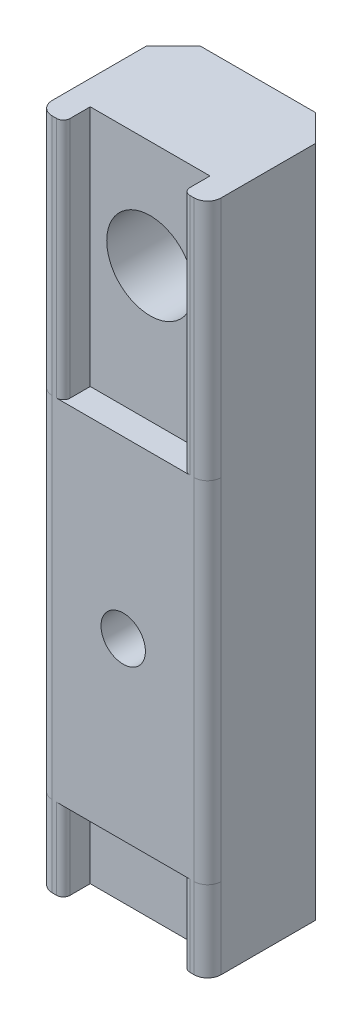
ISO-10303-21;
HEADER;
FILE_DESCRIPTION(('STEP AP214'),'2;1');
FILE_NAME('part.step','',(''),(''),'','','');
FILE_SCHEMA(('AUTOMOTIVE_DESIGN { 1 0 10303 214 1 1 1 1 }'));
ENDSEC;
DATA;
#1=APPLICATION_CONTEXT('core data for automotive mechanical design processes');
#2=APPLICATION_PROTOCOL_DEFINITION('international standard','automotive_design',2000,#1);
#3=PRODUCT_CONTEXT('',#1,'mechanical');
#4=PRODUCT('Part','Part','',(#3));
#5=PRODUCT_RELATED_PRODUCT_CATEGORY('part','',(#4));
#6=PRODUCT_DEFINITION_FORMATION('','',#4);
#7=PRODUCT_DEFINITION_CONTEXT('part definition',#1,'design');
#8=PRODUCT_DEFINITION('design','',#6,#7);
#9=PRODUCT_DEFINITION_SHAPE('','',#8);
#10=(LENGTH_UNIT() NAMED_UNIT(*) SI_UNIT(.MILLI.,.METRE.));
#11=(NAMED_UNIT(*) PLANE_ANGLE_UNIT() SI_UNIT($,.RADIAN.));
#12=(NAMED_UNIT(*) SI_UNIT($,.STERADIAN.) SOLID_ANGLE_UNIT());
#13=UNCERTAINTY_MEASURE_WITH_UNIT(LENGTH_MEASURE(1.E-05),#10,'distance_accuracy_value','');
#14=(GEOMETRIC_REPRESENTATION_CONTEXT(3) GLOBAL_UNCERTAINTY_ASSIGNED_CONTEXT((#13)) GLOBAL_UNIT_ASSIGNED_CONTEXT((#10,
#11,#12)) REPRESENTATION_CONTEXT('',''));
#15=CARTESIAN_POINT('',(0.,0.,0.));
#16=DIRECTION('',(0.,0.,1.));
#17=DIRECTION('',(1.,0.,0.));
#18=AXIS2_PLACEMENT_3D('',#15,#16,#17);
#19=CARTESIAN_POINT('',(0.,6.00000000000001,28.8704433634123));
#20=DIRECTION('',(0.,1.,0.));
#21=DIRECTION('',(0.,0.,1.));
#22=AXIS2_PLACEMENT_3D('',#19,#20,#21);
#23=PLANE('',#22);
#24=DIRECTION('',(-1.,0.,0.));
#25=VECTOR('',#24,1.);
#26=CARTESIAN_POINT('',(1.825,6.00000000000001,-2.));
#27=LINE('',#26,#25);
#28=CARTESIAN_POINT('',(10.725,6.00000000000001,-2.));
#29=VERTEX_POINT('',#28);
#30=CARTESIAN_POINT('',(1.825,6.00000000000001,-2.));
#31=VERTEX_POINT('',#30);
#32=EDGE_CURVE('E250',#29,#31,#27,.T.);
#33=ORIENTED_EDGE('',*,*,#32,.F.);
#34=DIRECTION('',(0.,0.,1.));
#35=VECTOR('',#34,1.);
#36=CARTESIAN_POINT('',(10.725,6.00000000000001,-2.));
#37=LINE('',#36,#35);
#38=CARTESIAN_POINT('',(10.725,6.00000000000001,-0.5));
#39=VERTEX_POINT('',#38);
#40=EDGE_CURVE('E338',#29,#39,#37,.T.);
#41=ORIENTED_EDGE('',*,*,#40,.T.);
#42=CARTESIAN_POINT('',(11.225,6.00000000000001,-0.5));
#43=DIRECTION('',(0.,1.,0.));
#44=DIRECTION('',(0.,0.,1.));
#45=AXIS2_PLACEMENT_3D('',#42,#43,#44);
#46=CIRCLE('',#45,0.5);
#47=CARTESIAN_POINT('',(11.225,6.00000000000001,0.));
#48=VERTEX_POINT('',#47);
#49=EDGE_CURVE('E254',#48,#39,#46,.F.);
#50=ORIENTED_EDGE('',*,*,#49,.F.);
#51=DIRECTION('',(-1.,0.,0.));
#52=VECTOR('',#51,1.);
#53=CARTESIAN_POINT('',(0.,6.00000000000001,0.));
#54=LINE('',#53,#52);
#55=CARTESIAN_POINT('',(1.325,6.00000000000001,0.));
#56=VERTEX_POINT('',#55);
#57=EDGE_CURVE('E317',#48,#56,#54,.T.);
#58=ORIENTED_EDGE('',*,*,#57,.T.);
#59=CARTESIAN_POINT('',(1.325,6.00000000000001,-0.5));
#60=DIRECTION('',(0.,1.,0.));
#61=DIRECTION('',(0.,0.,1.));
#62=AXIS2_PLACEMENT_3D('',#59,#60,#61);
#63=CIRCLE('',#62,0.5);
#64=CARTESIAN_POINT('',(1.825,6.00000000000001,-0.5));
#65=VERTEX_POINT('',#64);
#66=EDGE_CURVE('E253',#65,#56,#63,.F.);
#67=ORIENTED_EDGE('',*,*,#66,.F.);
#68=DIRECTION('',(0.,0.,-1.));
#69=VECTOR('',#68,1.);
#70=CARTESIAN_POINT('',(1.825,6.00000000000001,0.));
#71=LINE('',#70,#69);
#72=EDGE_CURVE('E238',#65,#31,#71,.T.);
#73=ORIENTED_EDGE('',*,*,#72,.T.);
#74=EDGE_LOOP('',(#33,#41,#50,#58,#67,#73));
#75=FACE_BOUND('',#74,.T.);
#76=ADVANCED_FACE('F36',(#75),#23,.F.);
#77=CARTESIAN_POINT('',(0.,32.,28.8704433634123));
#78=DIRECTION('',(0.,-1.,0.));
#79=DIRECTION('',(0.,0.,-1.));
#80=AXIS2_PLACEMENT_3D('',#77,#78,#79);
#81=PLANE('',#80);
#82=DIRECTION('',(1.,0.,0.));
#83=VECTOR('',#82,1.);
#84=CARTESIAN_POINT('',(1.825,32.,-2.));
#85=LINE('',#84,#83);
#86=CARTESIAN_POINT('',(1.825,32.,-2.));
#87=VERTEX_POINT('',#86);
#88=CARTESIAN_POINT('',(10.725,32.,-2.));
#89=VERTEX_POINT('',#88);
#90=EDGE_CURVE('E264',#87,#89,#85,.T.);
#91=ORIENTED_EDGE('',*,*,#90,.F.);
#92=DIRECTION('',(0.,0.,1.));
#93=VECTOR('',#92,1.);
#94=CARTESIAN_POINT('',(1.825,32.,0.));
#95=LINE('',#94,#93);
#96=CARTESIAN_POINT('',(1.825,32.,-0.5));
#97=VERTEX_POINT('',#96);
#98=EDGE_CURVE('E324',#87,#97,#95,.T.);
#99=ORIENTED_EDGE('',*,*,#98,.T.);
#100=CARTESIAN_POINT('',(1.325,32.,-0.5));
#101=DIRECTION('',(0.,-1.,0.));
#102=DIRECTION('',(0.,0.,-1.));
#103=AXIS2_PLACEMENT_3D('',#100,#101,#102);
#104=CIRCLE('',#103,0.5);
#105=CARTESIAN_POINT('',(1.325,32.,0.));
#106=VERTEX_POINT('',#105);
#107=EDGE_CURVE('E450',#106,#97,#104,.F.);
#108=ORIENTED_EDGE('',*,*,#107,.F.);
#109=DIRECTION('',(1.,0.,0.));
#110=VECTOR('',#109,1.);
#111=CARTESIAN_POINT('',(0.,32.,0.));
#112=LINE('',#111,#110);
#113=CARTESIAN_POINT('',(11.225,32.,0.));
#114=VERTEX_POINT('',#113);
#115=EDGE_CURVE('E319',#106,#114,#112,.T.);
#116=ORIENTED_EDGE('',*,*,#115,.T.);
#117=CARTESIAN_POINT('',(11.225,32.,-0.5));
#118=DIRECTION('',(0.,-1.,0.));
#119=DIRECTION('',(0.,0.,-1.));
#120=AXIS2_PLACEMENT_3D('',#117,#118,#119);
#121=CIRCLE('',#120,0.5);
#122=CARTESIAN_POINT('',(10.725,32.,-0.5));
#123=VERTEX_POINT('',#122);
#124=EDGE_CURVE('E326',#123,#114,#121,.F.);
#125=ORIENTED_EDGE('',*,*,#124,.F.);
#126=DIRECTION('',(0.,0.,-1.));
#127=VECTOR('',#126,1.);
#128=CARTESIAN_POINT('',(10.725,32.,-2.));
#129=LINE('',#128,#127);
#130=EDGE_CURVE('E329',#123,#89,#129,.T.);
#131=ORIENTED_EDGE('',*,*,#130,.T.);
#132=EDGE_LOOP('',(#91,#99,#108,#116,#125,#131));
#133=FACE_BOUND('',#132,.T.);
#134=ADVANCED_FACE('F467',(#133),#81,.F.);
#135=CARTESIAN_POINT('',(6.275,19.,0.));
#136=DIRECTION('',(0.,0.,-1.));
#137=DIRECTION('',(-1.,0.,0.));
#138=AXIS2_PLACEMENT_3D('',#135,#136,#137);
#139=CYLINDRICAL_SURFACE('',#138,1.65);
#140=CARTESIAN_POINT('',(6.275,19.,0.));
#141=DIRECTION('',(0.,0.,-1.));
#142=DIRECTION('',(-1.,0.,0.));
#143=AXIS2_PLACEMENT_3D('',#140,#141,#142);
#144=CIRCLE('',#143,1.65);
#145=CARTESIAN_POINT('',(4.625,19.,0.));
#146=VERTEX_POINT('',#145);
#147=EDGE_CURVE('E321',#146,#146,#144,.T.);
#148=ORIENTED_EDGE('',*,*,#147,.F.);
#149=EDGE_LOOP('',(#148));
#150=FACE_BOUND('',#149,.T.);
#151=CARTESIAN_POINT('',(6.275,19.,-6.));
#152=DIRECTION('',(0.,0.,-1.));
#153=DIRECTION('',(-1.,0.,0.));
#154=AXIS2_PLACEMENT_3D('',#151,#152,#153);
#155=CIRCLE('',#154,1.65);
#156=CARTESIAN_POINT('',(4.625,19.,-6.));
#157=VERTEX_POINT('',#156);
#158=EDGE_CURVE('E307',#157,#157,#155,.F.);
#159=ORIENTED_EDGE('',*,*,#158,.F.);
#160=EDGE_LOOP('',(#159));
#161=FACE_BOUND('',#160,.T.);
#162=ADVANCED_FACE('F464',(#150,#161),#139,.F.);
#163=CARTESIAN_POINT('',(11.55,50.,-1.));
#164=DIRECTION('',(0.,-1.,0.));
#165=DIRECTION('',(0.,0.,-1.));
#166=AXIS2_PLACEMENT_3D('',#163,#164,#165);
#167=CYLINDRICAL_SURFACE('',#166,1.);
#168=CARTESIAN_POINT('',(11.55,6.00000000000001,-1.));
#169=DIRECTION('',(0.,1.,0.));
#170=DIRECTION('',(0.,0.,1.));
#171=AXIS2_PLACEMENT_3D('',#168,#169,#170);
#172=CIRCLE('',#171,1.);
#173=CARTESIAN_POINT('',(11.55,6.00000000000001,0.));
#174=VERTEX_POINT('',#173);
#175=CARTESIAN_POINT('',(12.55,6.00000000000001,-1.));
#176=VERTEX_POINT('',#175);
#177=EDGE_CURVE('E343',#174,#176,#172,.T.);
#178=ORIENTED_EDGE('',*,*,#177,.F.);
#179=DIRECTION('',(0.,-1.,0.));
#180=VECTOR('',#179,1.);
#181=CARTESIAN_POINT('',(11.55,50.,0.));
#182=LINE('',#181,#180);
#183=CARTESIAN_POINT('',(11.55,0.,0.));
#184=VERTEX_POINT('',#183);
#185=EDGE_CURVE('E380',#174,#184,#182,.T.);
#186=ORIENTED_EDGE('',*,*,#185,.T.);
#187=CARTESIAN_POINT('',(11.55,0.,-1.));
#188=DIRECTION('',(0.,1.,0.));
#189=DIRECTION('',(0.,0.,1.));
#190=AXIS2_PLACEMENT_3D('',#187,#188,#189);
#191=CIRCLE('',#190,1.);
#192=CARTESIAN_POINT('',(12.55,0.,-1.));
#193=VERTEX_POINT('',#192);
#194=EDGE_CURVE('E357',#184,#193,#191,.T.);
#195=ORIENTED_EDGE('',*,*,#194,.T.);
#196=DIRECTION('',(0.,-1.,0.));
#197=VECTOR('',#196,1.);
#198=CARTESIAN_POINT('',(12.55,50.,-1.));
#199=LINE('',#198,#197);
#200=EDGE_CURVE('E422',#176,#193,#199,.T.);
#201=ORIENTED_EDGE('',*,*,#200,.F.);
#202=EDGE_LOOP('',(#178,#186,#195,#201));
#203=FACE_BOUND('',#202,.T.);
#204=ADVANCED_FACE('F466',(#203),#167,.T.);
#205=CARTESIAN_POINT('',(11.55,32.,-1.));
#206=DIRECTION('',(0.,-1.,0.));
#207=DIRECTION('',(0.,0.,-1.));
#208=AXIS2_PLACEMENT_3D('',#205,#206,#207);
#209=CIRCLE('',#208,1.);
#210=CARTESIAN_POINT('',(12.55,32.,-1.));
#211=VERTEX_POINT('',#210);
#212=CARTESIAN_POINT('',(11.55,32.,0.));
#213=VERTEX_POINT('',#212);
#214=EDGE_CURVE('E255',#211,#213,#209,.T.);
#215=ORIENTED_EDGE('',*,*,#214,.F.);
#216=CARTESIAN_POINT('',(12.55,50.,-1.));
#217=VERTEX_POINT('',#216);
#218=EDGE_CURVE('E423',#217,#211,#199,.T.);
#219=ORIENTED_EDGE('',*,*,#218,.F.);
#220=CARTESIAN_POINT('',(11.55,50.,-1.));
#221=DIRECTION('',(0.,1.,0.));
#222=DIRECTION('',(0.,0.,1.));
#223=AXIS2_PLACEMENT_3D('',#220,#221,#222);
#224=CIRCLE('',#223,1.);
#225=CARTESIAN_POINT('',(11.55,50.,0.));
#226=VERTEX_POINT('',#225);
#227=EDGE_CURVE('E360',#226,#217,#224,.T.);
#228=ORIENTED_EDGE('',*,*,#227,.F.);
#229=EDGE_CURVE('E400',#226,#213,#182,.T.);
#230=ORIENTED_EDGE('',*,*,#229,.T.);
#231=EDGE_LOOP('',(#215,#219,#228,#230));
#232=FACE_BOUND('',#231,.T.);
#233=ADVANCED_FACE('F474',(#232),#167,.T.);
#234=CARTESIAN_POINT('',(1.,50.,-1.));
#235=DIRECTION('',(0.,-1.,0.));
#236=DIRECTION('',(0.,0.,-1.));
#237=AXIS2_PLACEMENT_3D('',#234,#235,#236);
#238=CYLINDRICAL_SURFACE('',#237,1.);
#239=CARTESIAN_POINT('',(1.,6.00000000000001,-1.));
#240=DIRECTION('',(0.,1.,0.));
#241=DIRECTION('',(0.,0.,1.));
#242=AXIS2_PLACEMENT_3D('',#239,#240,#241);
#243=CIRCLE('',#242,1.);
#244=CARTESIAN_POINT('',(0.,6.00000000000001,-1.));
#245=VERTEX_POINT('',#244);
#246=CARTESIAN_POINT('',(1.,6.00000000000001,0.));
#247=VERTEX_POINT('',#246);
#248=EDGE_CURVE('E340',#245,#247,#243,.T.);
#249=ORIENTED_EDGE('',*,*,#248,.F.);
#250=DIRECTION('',(0.,-1.,0.));
#251=VECTOR('',#250,1.);
#252=CARTESIAN_POINT('',(0.,50.,-1.));
#253=LINE('',#252,#251);
#254=CARTESIAN_POINT('',(0.,0.,-1.));
#255=VERTEX_POINT('',#254);
#256=EDGE_CURVE('E406',#245,#255,#253,.T.);
#257=ORIENTED_EDGE('',*,*,#256,.T.);
#258=CARTESIAN_POINT('',(1.,0.,-1.));
#259=DIRECTION('',(0.,1.,0.));
#260=DIRECTION('',(0.,0.,-1.));
#261=AXIS2_PLACEMENT_3D('',#258,#259,#260);
#262=CIRCLE('',#261,1.);
#263=CARTESIAN_POINT('',(1.,0.,0.));
#264=VERTEX_POINT('',#263);
#265=EDGE_CURVE('E394',#255,#264,#262,.T.);
#266=ORIENTED_EDGE('',*,*,#265,.T.);
#267=DIRECTION('',(0.,-1.,0.));
#268=VECTOR('',#267,1.);
#269=CARTESIAN_POINT('',(1.,50.,0.));
#270=LINE('',#269,#268);
#271=EDGE_CURVE('E402',#247,#264,#270,.T.);
#272=ORIENTED_EDGE('',*,*,#271,.F.);
#273=EDGE_LOOP('',(#249,#257,#266,#272));
#274=FACE_BOUND('',#273,.T.);
#275=ADVANCED_FACE('F701',(#274),#238,.T.);
#276=CARTESIAN_POINT('',(1.,32.,-1.));
#277=DIRECTION('',(0.,-1.,0.));
#278=DIRECTION('',(0.,0.,-1.));
#279=AXIS2_PLACEMENT_3D('',#276,#277,#278);
#280=CIRCLE('',#279,1.);
#281=CARTESIAN_POINT('',(1.,32.,0.));
#282=VERTEX_POINT('',#281);
#283=CARTESIAN_POINT('',(0.,32.,-1.));
#284=VERTEX_POINT('',#283);
#285=EDGE_CURVE('E332',#282,#284,#280,.T.);
#286=ORIENTED_EDGE('',*,*,#285,.F.);
#287=CARTESIAN_POINT('',(1.,50.,0.));
#288=VERTEX_POINT('',#287);
#289=EDGE_CURVE('E403',#288,#282,#270,.T.);
#290=ORIENTED_EDGE('',*,*,#289,.F.);
#291=CARTESIAN_POINT('',(1.,50.,-1.));
#292=DIRECTION('',(0.,1.,0.));
#293=DIRECTION('',(0.,0.,-1.));
#294=AXIS2_PLACEMENT_3D('',#291,#292,#293);
#295=CIRCLE('',#294,1.);
#296=CARTESIAN_POINT('',(0.,50.,-1.));
#297=VERTEX_POINT('',#296);
#298=EDGE_CURVE('E374',#297,#288,#295,.T.);
#299=ORIENTED_EDGE('',*,*,#298,.F.);
#300=EDGE_CURVE('E407',#297,#284,#253,.T.);
#301=ORIENTED_EDGE('',*,*,#300,.T.);
#302=EDGE_LOOP('',(#286,#290,#299,#301));
#303=FACE_BOUND('',#302,.T.);
#304=ADVANCED_FACE('F695',(#303),#238,.T.);
#305=CARTESIAN_POINT('',(10.725,50.,-2.));
#306=DIRECTION('',(1.,0.,0.));
#307=DIRECTION('',(0.,0.,-1.));
#308=AXIS2_PLACEMENT_3D('',#305,#306,#307);
#309=PLANE('',#308);
#310=ORIENTED_EDGE('',*,*,#40,.F.);
#311=DIRECTION('',(0.,-1.,0.));
#312=VECTOR('',#311,1.);
#313=CARTESIAN_POINT('',(10.725,50.,-2.));
#314=LINE('',#313,#312);
#315=CARTESIAN_POINT('',(10.725,0.,-2.));
#316=VERTEX_POINT('',#315);
#317=EDGE_CURVE('E259',#29,#316,#314,.T.);
#318=ORIENTED_EDGE('',*,*,#317,.T.);
#319=DIRECTION('',(0.,0.,1.));
#320=VECTOR('',#319,1.);
#321=CARTESIAN_POINT('',(10.725,0.,-2.));
#322=LINE('',#321,#320);
#323=CARTESIAN_POINT('',(10.725,0.,-0.5));
#324=VERTEX_POINT('',#323);
#325=EDGE_CURVE('E350',#316,#324,#322,.T.);
#326=ORIENTED_EDGE('',*,*,#325,.T.);
#327=DIRECTION('',(0.,-1.,0.));
#328=VECTOR('',#327,1.);
#329=CARTESIAN_POINT('',(10.725,50.,-0.5));
#330=LINE('',#329,#328);
#331=EDGE_CURVE('E435',#324,#39,#330,.F.);
#332=ORIENTED_EDGE('',*,*,#331,.T.);
#333=EDGE_LOOP('',(#310,#318,#326,#332));
#334=FACE_BOUND('',#333,.T.);
#335=ADVANCED_FACE('F688',(#334),#309,.F.);
#336=ORIENTED_EDGE('',*,*,#130,.F.);
#337=CARTESIAN_POINT('',(10.725,50.,-0.5));
#338=VERTEX_POINT('',#337);
#339=EDGE_CURVE('E434',#123,#338,#330,.F.);
#340=ORIENTED_EDGE('',*,*,#339,.T.);
#341=DIRECTION('',(0.,0.,1.));
#342=VECTOR('',#341,1.);
#343=CARTESIAN_POINT('',(10.725,50.,-2.));
#344=LINE('',#343,#342);
#345=CARTESIAN_POINT('',(10.725,50.,-2.));
#346=VERTEX_POINT('',#345);
#347=EDGE_CURVE('E247',#346,#338,#344,.T.);
#348=ORIENTED_EDGE('',*,*,#347,.F.);
#349=EDGE_CURVE('E356',#346,#89,#314,.T.);
#350=ORIENTED_EDGE('',*,*,#349,.T.);
#351=EDGE_LOOP('',(#336,#340,#348,#350));
#352=FACE_BOUND('',#351,.T.);
#353=ADVANCED_FACE('F682',(#352),#309,.F.);
#354=CARTESIAN_POINT('',(1.825,50.,0.));
#355=DIRECTION('',(-1.,0.,0.));
#356=DIRECTION('',(0.,0.,1.));
#357=AXIS2_PLACEMENT_3D('',#354,#355,#356);
#358=PLANE('',#357);
#359=ORIENTED_EDGE('',*,*,#72,.F.);
#360=DIRECTION('',(0.,-1.,0.));
#361=VECTOR('',#360,1.);
#362=CARTESIAN_POINT('',(1.825,50.,-0.5));
#363=LINE('',#362,#361);
#364=CARTESIAN_POINT('',(1.825,0.,-0.5));
#365=VERTEX_POINT('',#364);
#366=EDGE_CURVE('E442',#65,#365,#363,.T.);
#367=ORIENTED_EDGE('',*,*,#366,.T.);
#368=DIRECTION('',(0.,0.,-1.));
#369=VECTOR('',#368,1.);
#370=CARTESIAN_POINT('',(1.825,0.,0.));
#371=LINE('',#370,#369);
#372=CARTESIAN_POINT('',(1.825,0.,-2.));
#373=VERTEX_POINT('',#372);
#374=EDGE_CURVE('E241',#365,#373,#371,.T.);
#375=ORIENTED_EDGE('',*,*,#374,.T.);
#376=DIRECTION('',(0.,-1.,0.));
#377=VECTOR('',#376,1.);
#378=CARTESIAN_POINT('',(1.825,50.,-2.));
#379=LINE('',#378,#377);
#380=EDGE_CURVE('E235',#31,#373,#379,.T.);
#381=ORIENTED_EDGE('',*,*,#380,.F.);
#382=EDGE_LOOP('',(#359,#367,#375,#381));
#383=FACE_BOUND('',#382,.T.);
#384=ADVANCED_FACE('F237',(#383),#358,.F.);
#385=ORIENTED_EDGE('',*,*,#98,.F.);
#386=CARTESIAN_POINT('',(1.825,50.,-2.));
#387=VERTEX_POINT('',#386);
#388=EDGE_CURVE('E246',#387,#87,#379,.T.);
#389=ORIENTED_EDGE('',*,*,#388,.F.);
#390=DIRECTION('',(0.,0.,-1.));
#391=VECTOR('',#390,1.);
#392=CARTESIAN_POINT('',(1.825,50.,0.));
#393=LINE('',#392,#391);
#394=CARTESIAN_POINT('',(1.825,50.,-0.5));
#395=VERTEX_POINT('',#394);
#396=EDGE_CURVE('E348',#395,#387,#393,.T.);
#397=ORIENTED_EDGE('',*,*,#396,.F.);
#398=EDGE_CURVE('E443',#395,#97,#363,.T.);
#399=ORIENTED_EDGE('',*,*,#398,.T.);
#400=EDGE_LOOP('',(#385,#389,#397,#399));
#401=FACE_BOUND('',#400,.T.);
#402=ADVANCED_FACE('F669',(#401),#358,.F.);
#403=CARTESIAN_POINT('',(11.225,50.,-0.5));
#404=DIRECTION('',(0.,-1.,0.));
#405=DIRECTION('',(0.,0.,-1.));
#406=AXIS2_PLACEMENT_3D('',#403,#404,#405);
#407=CYLINDRICAL_SURFACE('',#406,0.5);
#408=DIRECTION('',(0.,-1.,0.));
#409=VECTOR('',#408,1.);
#410=CARTESIAN_POINT('',(11.225,50.,0.));
#411=LINE('',#410,#409);
#412=CARTESIAN_POINT('',(11.225,0.,0.));
#413=VERTEX_POINT('',#412);
#414=EDGE_CURVE('E426',#48,#413,#411,.T.);
#415=ORIENTED_EDGE('',*,*,#414,.F.);
#416=ORIENTED_EDGE('',*,*,#49,.T.);
#417=ORIENTED_EDGE('',*,*,#331,.F.);
#418=CARTESIAN_POINT('',(11.225,0.,-0.5));
#419=DIRECTION('',(0.,1.,0.));
#420=DIRECTION('',(0.,0.,1.));
#421=AXIS2_PLACEMENT_3D('',#418,#419,#420);
#422=CIRCLE('',#421,0.5);
#423=EDGE_CURVE('E432',#413,#324,#422,.F.);
#424=ORIENTED_EDGE('',*,*,#423,.F.);
#425=EDGE_LOOP('',(#415,#416,#417,#424));
#426=FACE_BOUND('',#425,.T.);
#427=ADVANCED_FACE('F662',(#426),#407,.T.);
#428=ORIENTED_EDGE('',*,*,#339,.F.);
#429=ORIENTED_EDGE('',*,*,#124,.T.);
#430=CARTESIAN_POINT('',(11.225,50.,0.));
#431=VERTEX_POINT('',#430);
#432=EDGE_CURVE('E427',#431,#114,#411,.T.);
#433=ORIENTED_EDGE('',*,*,#432,.F.);
#434=CARTESIAN_POINT('',(11.225,50.,-0.5));
#435=DIRECTION('',(0.,1.,0.));
#436=DIRECTION('',(0.,0.,1.));
#437=AXIS2_PLACEMENT_3D('',#434,#435,#436);
#438=CIRCLE('',#437,0.5);
#439=EDGE_CURVE('E440',#338,#431,#438,.T.);
#440=ORIENTED_EDGE('',*,*,#439,.F.);
#441=EDGE_LOOP('',(#428,#429,#433,#440));
#442=FACE_BOUND('',#441,.T.);
#443=ADVANCED_FACE('F655',(#442),#407,.T.);
#444=CARTESIAN_POINT('',(1.325,50.,-0.5));
#445=DIRECTION('',(0.,-1.,0.));
#446=DIRECTION('',(0.,0.,-1.));
#447=AXIS2_PLACEMENT_3D('',#444,#445,#446);
#448=CYLINDRICAL_SURFACE('',#447,0.5);
#449=ORIENTED_EDGE('',*,*,#366,.F.);
#450=ORIENTED_EDGE('',*,*,#66,.T.);
#451=DIRECTION('',(0.,-1.,0.));
#452=VECTOR('',#451,1.);
#453=CARTESIAN_POINT('',(1.325,50.,0.));
#454=LINE('',#453,#452);
#455=CARTESIAN_POINT('',(1.325,0.,0.));
#456=VERTEX_POINT('',#455);
#457=EDGE_CURVE('E447',#456,#56,#454,.F.);
#458=ORIENTED_EDGE('',*,*,#457,.F.);
#459=CARTESIAN_POINT('',(1.325,0.,-0.5));
#460=DIRECTION('',(0.,1.,0.));
#461=DIRECTION('',(0.,0.,1.));
#462=AXIS2_PLACEMENT_3D('',#459,#460,#461);
#463=CIRCLE('',#462,0.5);
#464=EDGE_CURVE('E430',#365,#456,#463,.F.);
#465=ORIENTED_EDGE('',*,*,#464,.F.);
#466=EDGE_LOOP('',(#449,#450,#458,#465));
#467=FACE_BOUND('',#466,.T.);
#468=ADVANCED_FACE('F646',(#467),#448,.T.);
#469=CARTESIAN_POINT('',(1.325,50.,0.));
#470=VERTEX_POINT('',#469);
#471=EDGE_CURVE('E446',#106,#470,#454,.F.);
#472=ORIENTED_EDGE('',*,*,#471,.F.);
#473=ORIENTED_EDGE('',*,*,#107,.T.);
#474=ORIENTED_EDGE('',*,*,#398,.F.);
#475=CARTESIAN_POINT('',(1.325,50.,-0.5));
#476=DIRECTION('',(0.,1.,0.));
#477=DIRECTION('',(0.,0.,1.));
#478=AXIS2_PLACEMENT_3D('',#475,#476,#477);
#479=CIRCLE('',#478,0.5);
#480=EDGE_CURVE('E438',#470,#395,#479,.T.);
#481=ORIENTED_EDGE('',*,*,#480,.F.);
#482=EDGE_LOOP('',(#472,#473,#474,#481));
#483=FACE_BOUND('',#482,.T.);
#484=ADVANCED_FACE('F637',(#483),#448,.T.);
#485=CARTESIAN_POINT('',(12.55,50.,-1.));
#486=DIRECTION('',(-1.,0.,0.));
#487=DIRECTION('',(0.,0.,1.));
#488=AXIS2_PLACEMENT_3D('',#485,#486,#487);
#489=PLANE('',#488);
#490=ORIENTED_EDGE('',*,*,#218,.T.);
#491=DIRECTION('',(0.,-1.,0.));
#492=VECTOR('',#491,1.);
#493=CARTESIAN_POINT('',(12.55,50.,-1.));
#494=LINE('',#493,#492);
#495=EDGE_CURVE('E454',#211,#176,#494,.T.);
#496=ORIENTED_EDGE('',*,*,#495,.T.);
#497=ORIENTED_EDGE('',*,*,#200,.T.);
#498=DIRECTION('',(0.,0.,-1.));
#499=VECTOR('',#498,1.);
#500=CARTESIAN_POINT('',(12.55,0.,-1.));
#501=LINE('',#500,#499);
#502=CARTESIAN_POINT('',(12.55,0.,-8.));
#503=VERTEX_POINT('',#502);
#504=EDGE_CURVE('E383',#193,#503,#501,.T.);
#505=ORIENTED_EDGE('',*,*,#504,.T.);
#506=DIRECTION('',(0.,-1.,0.));
#507=VECTOR('',#506,1.);
#508=CARTESIAN_POINT('',(12.55,50.,-8.));
#509=LINE('',#508,#507);
#510=CARTESIAN_POINT('',(12.55,50.,-8.));
#511=VERTEX_POINT('',#510);
#512=EDGE_CURVE('E419',#511,#503,#509,.T.);
#513=ORIENTED_EDGE('',*,*,#512,.F.);
#514=DIRECTION('',(0.,0.,-1.));
#515=VECTOR('',#514,1.);
#516=CARTESIAN_POINT('',(12.55,50.,-1.));
#517=LINE('',#516,#515);
#518=EDGE_CURVE('E363',#217,#511,#517,.T.);
#519=ORIENTED_EDGE('',*,*,#518,.F.);
#520=EDGE_LOOP('',(#490,#496,#497,#505,#513,#519));
#521=FACE_BOUND('',#520,.T.);
#522=ADVANCED_FACE('F630',(#521),#489,.F.);
#523=CARTESIAN_POINT('',(10.55,50.,-10.));
#524=DIRECTION('',(-0.707106781186547,0.,0.707106781186548));
#525=DIRECTION('',(0.707106781186548,0.,0.707106781186547));
#526=AXIS2_PLACEMENT_3D('',#523,#524,#525);
#527=PLANE('',#526);
#528=DIRECTION('',(-0.707106781186548,0.,-0.707106781186547));
#529=VECTOR('',#528,1.);
#530=CARTESIAN_POINT('',(10.55,0.,-10.));
#531=LINE('',#530,#529);
#532=CARTESIAN_POINT('',(10.55,0.,-10.));
#533=VERTEX_POINT('',#532);
#534=EDGE_CURVE('E385',#503,#533,#531,.T.);
#535=ORIENTED_EDGE('',*,*,#534,.T.);
#536=DIRECTION('',(0.,-1.,0.));
#537=VECTOR('',#536,1.);
#538=CARTESIAN_POINT('',(10.55,50.,-10.));
#539=LINE('',#538,#537);
#540=CARTESIAN_POINT('',(10.55,50.,-10.));
#541=VERTEX_POINT('',#540);
#542=EDGE_CURVE('E416',#541,#533,#539,.T.);
#543=ORIENTED_EDGE('',*,*,#542,.F.);
#544=DIRECTION('',(-0.707106781186548,0.,-0.707106781186547));
#545=VECTOR('',#544,1.);
#546=CARTESIAN_POINT('',(10.55,50.,-10.));
#547=LINE('',#546,#545);
#548=EDGE_CURVE('E366',#511,#541,#547,.T.);
#549=ORIENTED_EDGE('',*,*,#548,.F.);
#550=ORIENTED_EDGE('',*,*,#512,.T.);
#551=EDGE_LOOP('',(#535,#543,#549,#550));
#552=FACE_BOUND('',#551,.T.);
#553=ADVANCED_FACE('F623',(#552),#527,.F.);
#554=CARTESIAN_POINT('',(2.,50.,-10.));
#555=DIRECTION('',(0.,0.,1.));
#556=DIRECTION('',(1.,0.,0.));
#557=AXIS2_PLACEMENT_3D('',#554,#555,#556);
#558=PLANE('',#557);
#559=DIRECTION('',(0.5,0.866025403784438,0.));
#560=VECTOR('',#559,1.);
#561=CARTESIAN_POINT('',(3.01297097907861,19.,-10.));
#562=LINE('',#561,#560);
#563=CARTESIAN_POINT('',(3.01297097907861,19.,-10.));
#564=VERTEX_POINT('',#563);
#565=CARTESIAN_POINT('',(4.64398548953931,21.825,-10.));
#566=VERTEX_POINT('',#565);
#567=EDGE_CURVE('E291',#564,#566,#562,.T.);
#568=ORIENTED_EDGE('',*,*,#567,.F.);
#569=DIRECTION('',(-0.5,0.866025403784439,0.));
#570=VECTOR('',#569,1.);
#571=CARTESIAN_POINT('',(4.6439854895393,16.175,-10.));
#572=LINE('',#571,#570);
#573=CARTESIAN_POINT('',(4.6439854895393,16.175,-10.));
#574=VERTEX_POINT('',#573);
#575=EDGE_CURVE('E53',#574,#564,#572,.T.);
#576=ORIENTED_EDGE('',*,*,#575,.F.);
#577=DIRECTION('',(-1.,0.,0.));
#578=VECTOR('',#577,1.);
#579=CARTESIAN_POINT('',(7.90601451046069,16.175,-10.));
#580=LINE('',#579,#578);
#581=CARTESIAN_POINT('',(7.90601451046069,16.175,-10.));
#582=VERTEX_POINT('',#581);
#583=EDGE_CURVE('E274',#582,#574,#580,.T.);
#584=ORIENTED_EDGE('',*,*,#583,.F.);
#585=DIRECTION('',(-0.5,-0.866025403784438,0.));
#586=VECTOR('',#585,1.);
#587=CARTESIAN_POINT('',(9.53702902092139,19.,-10.));
#588=LINE('',#587,#586);
#589=CARTESIAN_POINT('',(9.53702902092139,19.,-10.));
#590=VERTEX_POINT('',#589);
#591=EDGE_CURVE('E300',#590,#582,#588,.T.);
#592=ORIENTED_EDGE('',*,*,#591,.F.);
#593=DIRECTION('',(0.5,-0.866025403784439,0.));
#594=VECTOR('',#593,1.);
#595=CARTESIAN_POINT('',(7.90601451046069,21.825,-10.));
#596=LINE('',#595,#594);
#597=CARTESIAN_POINT('',(7.90601451046069,21.825,-10.));
#598=VERTEX_POINT('',#597);
#599=EDGE_CURVE('E297',#598,#590,#596,.T.);
#600=ORIENTED_EDGE('',*,*,#599,.F.);
#601=DIRECTION('',(1.,0.,0.));
#602=VECTOR('',#601,1.);
#603=CARTESIAN_POINT('',(4.64398548953931,21.825,-10.));
#604=LINE('',#603,#602);
#605=EDGE_CURVE('E294',#566,#598,#604,.T.);
#606=ORIENTED_EDGE('',*,*,#605,.F.);
#607=EDGE_LOOP('',(#568,#576,#584,#592,#600,#606));
#608=FACE_BOUND('',#607,.T.);
#609=CARTESIAN_POINT('',(6.275,42.,-10.));
#610=DIRECTION('',(0.,0.,-1.));
#611=DIRECTION('',(-1.,0.,0.));
#612=AXIS2_PLACEMENT_3D('',#609,#610,#611);
#613=CIRCLE('',#612,3.225);
#614=CARTESIAN_POINT('',(3.05,42.,-10.));
#615=VERTEX_POINT('',#614);
#616=EDGE_CURVE('E345',#615,#615,#613,.T.);
#617=ORIENTED_EDGE('',*,*,#616,.F.);
#618=EDGE_LOOP('',(#617));
#619=FACE_BOUND('',#618,.T.);
#620=DIRECTION('',(-1.,0.,0.));
#621=VECTOR('',#620,1.);
#622=CARTESIAN_POINT('',(2.,0.,-10.));
#623=LINE('',#622,#621);
#624=CARTESIAN_POINT('',(2.,0.,-10.));
#625=VERTEX_POINT('',#624);
#626=EDGE_CURVE('E387',#533,#625,#623,.T.);
#627=ORIENTED_EDGE('',*,*,#626,.T.);
#628=DIRECTION('',(0.,-1.,0.));
#629=VECTOR('',#628,1.);
#630=CARTESIAN_POINT('',(2.,50.,-10.));
#631=LINE('',#630,#629);
#632=CARTESIAN_POINT('',(2.,50.,-10.));
#633=VERTEX_POINT('',#632);
#634=EDGE_CURVE('E413',#633,#625,#631,.T.);
#635=ORIENTED_EDGE('',*,*,#634,.F.);
#636=DIRECTION('',(-1.,0.,0.));
#637=VECTOR('',#636,1.);
#638=CARTESIAN_POINT('',(2.,50.,-10.));
#639=LINE('',#638,#637);
#640=EDGE_CURVE('E368',#541,#633,#639,.T.);
#641=ORIENTED_EDGE('',*,*,#640,.F.);
#642=ORIENTED_EDGE('',*,*,#542,.T.);
#643=EDGE_LOOP('',(#627,#635,#641,#642));
#644=FACE_BOUND('',#643,.T.);
#645=ADVANCED_FACE('F614',(#608,#619,#644),#558,.F.);
#646=CARTESIAN_POINT('',(0.,50.,-8.));
#647=DIRECTION('',(0.707106781186548,0.,0.707106781186547));
#648=DIRECTION('',(0.707106781186547,0.,-0.707106781186548));
#649=AXIS2_PLACEMENT_3D('',#646,#647,#648);
#650=PLANE('',#649);
#651=DIRECTION('',(-0.707106781186547,0.,0.707106781186548));
#652=VECTOR('',#651,1.);
#653=CARTESIAN_POINT('',(0.,0.,-8.));
#654=LINE('',#653,#652);
#655=CARTESIAN_POINT('',(0.,0.,-8.));
#656=VERTEX_POINT('',#655);
#657=EDGE_CURVE('E389',#625,#656,#654,.T.);
#658=ORIENTED_EDGE('',*,*,#657,.T.);
#659=DIRECTION('',(0.,-1.,0.));
#660=VECTOR('',#659,1.);
#661=CARTESIAN_POINT('',(0.,50.,-8.));
#662=LINE('',#661,#660);
#663=CARTESIAN_POINT('',(0.,50.,-8.));
#664=VERTEX_POINT('',#663);
#665=EDGE_CURVE('E410',#664,#656,#662,.T.);
#666=ORIENTED_EDGE('',*,*,#665,.F.);
#667=DIRECTION('',(-0.707106781186547,0.,0.707106781186548));
#668=VECTOR('',#667,1.);
#669=CARTESIAN_POINT('',(0.,50.,-8.));
#670=LINE('',#669,#668);
#671=EDGE_CURVE('E370',#633,#664,#670,.T.);
#672=ORIENTED_EDGE('',*,*,#671,.F.);
#673=ORIENTED_EDGE('',*,*,#634,.T.);
#674=EDGE_LOOP('',(#658,#666,#672,#673));
#675=FACE_BOUND('',#674,.T.);
#676=ADVANCED_FACE('F605',(#675),#650,.F.);
#677=CARTESIAN_POINT('',(0.,50.,-1.));
#678=DIRECTION('',(1.,0.,0.));
#679=DIRECTION('',(0.,0.,-1.));
#680=AXIS2_PLACEMENT_3D('',#677,#678,#679);
#681=PLANE('',#680);
#682=ORIENTED_EDGE('',*,*,#256,.F.);
#683=DIRECTION('',(0.,1.,0.));
#684=VECTOR('',#683,1.);
#685=CARTESIAN_POINT('',(0.,50.,-1.));
#686=LINE('',#685,#684);
#687=EDGE_CURVE('E11',#245,#284,#686,.T.);
#688=ORIENTED_EDGE('',*,*,#687,.T.);
#689=ORIENTED_EDGE('',*,*,#300,.F.);
#690=DIRECTION('',(0.,0.,1.));
#691=VECTOR('',#690,1.);
#692=CARTESIAN_POINT('',(0.,50.,-1.));
#693=LINE('',#692,#691);
#694=EDGE_CURVE('E372',#664,#297,#693,.T.);
#695=ORIENTED_EDGE('',*,*,#694,.F.);
#696=ORIENTED_EDGE('',*,*,#665,.T.);
#697=DIRECTION('',(0.,0.,1.));
#698=VECTOR('',#697,1.);
#699=CARTESIAN_POINT('',(0.,0.,-1.));
#700=LINE('',#699,#698);
#701=EDGE_CURVE('E391',#656,#255,#700,.T.);
#702=ORIENTED_EDGE('',*,*,#701,.T.);
#703=EDGE_LOOP('',(#682,#688,#689,#695,#696,#702));
#704=FACE_BOUND('',#703,.T.);
#705=ADVANCED_FACE('F598',(#704),#681,.F.);
#706=CARTESIAN_POINT('',(1.,50.,0.));
#707=DIRECTION('',(0.,0.,-1.));
#708=DIRECTION('',(-1.,0.,0.));
#709=AXIS2_PLACEMENT_3D('',#706,#707,#708);
#710=PLANE('',#709);
#711=ORIENTED_EDGE('',*,*,#185,.F.);
#712=DIRECTION('',(0.,-1.,0.));
#713=VECTOR('',#712,1.);
#714=CARTESIAN_POINT('',(11.55,50.,0.));
#715=LINE('',#714,#713);
#716=EDGE_CURVE('E45',#174,#213,#715,.F.);
#717=ORIENTED_EDGE('',*,*,#716,.T.);
#718=ORIENTED_EDGE('',*,*,#229,.F.);
#719=DIRECTION('',(1.,0.,0.));
#720=VECTOR('',#719,1.);
#721=CARTESIAN_POINT('',(1.,50.,0.));
#722=LINE('',#721,#720);
#723=EDGE_CURVE('E376',#431,#226,#722,.T.);
#724=ORIENTED_EDGE('',*,*,#723,.F.);
#725=ORIENTED_EDGE('',*,*,#432,.T.);
#726=ORIENTED_EDGE('',*,*,#115,.F.);
#727=ORIENTED_EDGE('',*,*,#471,.T.);
#728=EDGE_CURVE('E377',#288,#470,#722,.T.);
#729=ORIENTED_EDGE('',*,*,#728,.F.);
#730=ORIENTED_EDGE('',*,*,#289,.T.);
#731=DIRECTION('',(0.,1.,0.));
#732=VECTOR('',#731,1.);
#733=CARTESIAN_POINT('',(1.,50.,0.));
#734=LINE('',#733,#732);
#735=EDGE_CURVE('E457',#282,#247,#734,.F.);
#736=ORIENTED_EDGE('',*,*,#735,.T.);
#737=ORIENTED_EDGE('',*,*,#271,.T.);
#738=DIRECTION('',(1.,0.,0.));
#739=VECTOR('',#738,1.);
#740=CARTESIAN_POINT('',(1.,0.,0.));
#741=LINE('',#740,#739);
#742=EDGE_CURVE('E364',#264,#456,#741,.T.);
#743=ORIENTED_EDGE('',*,*,#742,.T.);
#744=ORIENTED_EDGE('',*,*,#457,.T.);
#745=ORIENTED_EDGE('',*,*,#57,.F.);
#746=ORIENTED_EDGE('',*,*,#414,.T.);
#747=EDGE_CURVE('E397',#413,#184,#741,.T.);
#748=ORIENTED_EDGE('',*,*,#747,.T.);
#749=EDGE_LOOP('',(#711,#717,#718,#724,#725,#726,#727,#729,#730,#736,#737,#743,#744,#745,#746,#748));
#750=FACE_BOUND('',#749,.T.);
#751=ORIENTED_EDGE('',*,*,#147,.T.);
#752=EDGE_LOOP('',(#751));
#753=FACE_BOUND('',#752,.T.);
#754=ADVANCED_FACE('F590',(#750,#753),#710,.F.);
#755=CARTESIAN_POINT('',(11.55,50.,-1.));
#756=DIRECTION('',(0.,1.,0.));
#757=DIRECTION('',(0.,0.,1.));
#758=AXIS2_PLACEMENT_3D('',#755,#756,#757);
#759=PLANE('',#758);
#760=DIRECTION('',(1.,0.,0.));
#761=VECTOR('',#760,1.);
#762=CARTESIAN_POINT('',(1.825,50.,-2.));
#763=LINE('',#762,#761);
#764=EDGE_CURVE('E267',#387,#346,#763,.T.);
#765=ORIENTED_EDGE('',*,*,#764,.T.);
#766=ORIENTED_EDGE('',*,*,#347,.T.);
#767=ORIENTED_EDGE('',*,*,#439,.T.);
#768=ORIENTED_EDGE('',*,*,#723,.T.);
#769=ORIENTED_EDGE('',*,*,#227,.T.);
#770=ORIENTED_EDGE('',*,*,#518,.T.);
#771=ORIENTED_EDGE('',*,*,#548,.T.);
#772=ORIENTED_EDGE('',*,*,#640,.T.);
#773=ORIENTED_EDGE('',*,*,#671,.T.);
#774=ORIENTED_EDGE('',*,*,#694,.T.);
#775=ORIENTED_EDGE('',*,*,#298,.T.);
#776=ORIENTED_EDGE('',*,*,#728,.T.);
#777=ORIENTED_EDGE('',*,*,#480,.T.);
#778=ORIENTED_EDGE('',*,*,#396,.T.);
#779=EDGE_LOOP('',(#765,#766,#767,#768,#769,#770,#771,#772,#773,#774,#775,#776,#777,#778));
#780=FACE_BOUND('',#779,.T.);
#781=ADVANCED_FACE('F582',(#780),#759,.T.);
#782=CARTESIAN_POINT('',(11.55,0.,-1.));
#783=DIRECTION('',(0.,1.,0.));
#784=DIRECTION('',(0.,0.,1.));
#785=AXIS2_PLACEMENT_3D('',#782,#783,#784);
#786=PLANE('',#785);
#787=ORIENTED_EDGE('',*,*,#325,.F.);
#788=DIRECTION('',(1.,0.,0.));
#789=VECTOR('',#788,1.);
#790=CARTESIAN_POINT('',(1.825,0.,-2.));
#791=LINE('',#790,#789);
#792=EDGE_CURVE('E260',#373,#316,#791,.T.);
#793=ORIENTED_EDGE('',*,*,#792,.F.);
#794=ORIENTED_EDGE('',*,*,#374,.F.);
#795=ORIENTED_EDGE('',*,*,#464,.T.);
#796=ORIENTED_EDGE('',*,*,#742,.F.);
#797=ORIENTED_EDGE('',*,*,#265,.F.);
#798=ORIENTED_EDGE('',*,*,#701,.F.);
#799=ORIENTED_EDGE('',*,*,#657,.F.);
#800=ORIENTED_EDGE('',*,*,#626,.F.);
#801=ORIENTED_EDGE('',*,*,#534,.F.);
#802=ORIENTED_EDGE('',*,*,#504,.F.);
#803=ORIENTED_EDGE('',*,*,#194,.F.);
#804=ORIENTED_EDGE('',*,*,#747,.F.);
#805=ORIENTED_EDGE('',*,*,#423,.T.);
#806=EDGE_LOOP('',(#787,#793,#794,#795,#796,#797,#798,#799,#800,#801,#802,#803,#804,#805));
#807=FACE_BOUND('',#806,.T.);
#808=ADVANCED_FACE('F575',(#807),#786,.F.);
#809=CARTESIAN_POINT('',(6.275,42.,0.));
#810=DIRECTION('',(0.,0.,-1.));
#811=DIRECTION('',(-1.,0.,0.));
#812=AXIS2_PLACEMENT_3D('',#809,#810,#811);
#813=CYLINDRICAL_SURFACE('',#812,3.225);
#814=ORIENTED_EDGE('',*,*,#616,.T.);
#815=EDGE_LOOP('',(#814));
#816=FACE_BOUND('',#815,.T.);
#817=CARTESIAN_POINT('',(6.275,42.,-2.));
#818=DIRECTION('',(0.,0.,-1.));
#819=DIRECTION('',(-1.,0.,0.));
#820=AXIS2_PLACEMENT_3D('',#817,#818,#819);
#821=CIRCLE('',#820,3.225);
#822=CARTESIAN_POINT('',(3.05,42.,-2.));
#823=VERTEX_POINT('',#822);
#824=EDGE_CURVE('E40',#823,#823,#821,.T.);
#825=ORIENTED_EDGE('',*,*,#824,.F.);
#826=EDGE_LOOP('',(#825));
#827=FACE_BOUND('',#826,.T.);
#828=ADVANCED_FACE('F568',(#816,#827),#813,.F.);
#829=CARTESIAN_POINT('',(11.55,50.,-1.));
#830=DIRECTION('',(0.,-1.,0.));
#831=DIRECTION('',(0.,0.,-1.));
#832=AXIS2_PLACEMENT_3D('',#829,#830,#831);
#833=CYLINDRICAL_SURFACE('',#832,1.);
#834=ORIENTED_EDGE('',*,*,#214,.T.);
#835=ORIENTED_EDGE('',*,*,#716,.F.);
#836=ORIENTED_EDGE('',*,*,#177,.T.);
#837=ORIENTED_EDGE('',*,*,#495,.F.);
#838=EDGE_LOOP('',(#834,#835,#836,#837));
#839=FACE_BOUND('',#838,.T.);
#840=ADVANCED_FACE('F561',(#839),#833,.T.);
#841=CARTESIAN_POINT('',(1.,50.,-1.));
#842=DIRECTION('',(0.,1.,0.));
#843=DIRECTION('',(0.,0.,1.));
#844=AXIS2_PLACEMENT_3D('',#841,#842,#843);
#845=CYLINDRICAL_SURFACE('',#844,1.);
#846=ORIENTED_EDGE('',*,*,#248,.T.);
#847=ORIENTED_EDGE('',*,*,#735,.F.);
#848=ORIENTED_EDGE('',*,*,#285,.T.);
#849=ORIENTED_EDGE('',*,*,#687,.F.);
#850=EDGE_LOOP('',(#846,#847,#848,#849));
#851=FACE_BOUND('',#850,.T.);
#852=ADVANCED_FACE('F38',(#851),#845,.T.);
#853=CARTESIAN_POINT('',(0.,0.,-6.));
#854=DIRECTION('',(0.,0.,-1.));
#855=DIRECTION('',(-1.,0.,0.));
#856=AXIS2_PLACEMENT_3D('',#853,#854,#855);
#857=PLANE('',#856);
#858=DIRECTION('',(-0.5,0.866025403784439,0.));
#859=VECTOR('',#858,1.);
#860=CARTESIAN_POINT('',(4.6439854895393,16.175,-6.));
#861=LINE('',#860,#859);
#862=CARTESIAN_POINT('',(4.6439854895393,16.175,-6.));
#863=VERTEX_POINT('',#862);
#864=CARTESIAN_POINT('',(3.01297097907861,19.,-6.));
#865=VERTEX_POINT('',#864);
#866=EDGE_CURVE('E270',#863,#865,#861,.T.);
#867=ORIENTED_EDGE('',*,*,#866,.T.);
#868=DIRECTION('',(0.5,0.866025403784438,0.));
#869=VECTOR('',#868,1.);
#870=CARTESIAN_POINT('',(3.01297097907861,19.,-6.));
#871=LINE('',#870,#869);
#872=CARTESIAN_POINT('',(4.64398548953931,21.825,-6.));
#873=VERTEX_POINT('',#872);
#874=EDGE_CURVE('E273',#865,#873,#871,.T.);
#875=ORIENTED_EDGE('',*,*,#874,.T.);
#876=DIRECTION('',(1.,0.,0.));
#877=VECTOR('',#876,1.);
#878=CARTESIAN_POINT('',(4.64398548953931,21.825,-6.));
#879=LINE('',#878,#877);
#880=CARTESIAN_POINT('',(7.90601451046069,21.825,-6.));
#881=VERTEX_POINT('',#880);
#882=EDGE_CURVE('E277',#873,#881,#879,.T.);
#883=ORIENTED_EDGE('',*,*,#882,.T.);
#884=DIRECTION('',(0.5,-0.866025403784439,0.));
#885=VECTOR('',#884,1.);
#886=CARTESIAN_POINT('',(7.90601451046069,21.825,-6.));
#887=LINE('',#886,#885);
#888=CARTESIAN_POINT('',(9.53702902092139,19.,-6.));
#889=VERTEX_POINT('',#888);
#890=EDGE_CURVE('E280',#881,#889,#887,.T.);
#891=ORIENTED_EDGE('',*,*,#890,.T.);
#892=DIRECTION('',(-0.5,-0.866025403784438,0.));
#893=VECTOR('',#892,1.);
#894=CARTESIAN_POINT('',(9.53702902092139,19.,-6.));
#895=LINE('',#894,#893);
#896=CARTESIAN_POINT('',(7.90601451046069,16.175,-6.));
#897=VERTEX_POINT('',#896);
#898=EDGE_CURVE('E283',#889,#897,#895,.T.);
#899=ORIENTED_EDGE('',*,*,#898,.T.);
#900=DIRECTION('',(-1.,0.,0.));
#901=VECTOR('',#900,1.);
#902=CARTESIAN_POINT('',(7.90601451046069,16.175,-6.));
#903=LINE('',#902,#901);
#904=EDGE_CURVE('E286',#897,#863,#903,.T.);
#905=ORIENTED_EDGE('',*,*,#904,.T.);
#906=EDGE_LOOP('',(#867,#875,#883,#891,#899,#905));
#907=FACE_BOUND('',#906,.T.);
#908=ORIENTED_EDGE('',*,*,#158,.T.);
#909=EDGE_LOOP('',(#908));
#910=FACE_BOUND('',#909,.T.);
#911=ADVANCED_FACE('F462',(#907,#910),#857,.T.);
#912=CARTESIAN_POINT('',(4.6439854895393,16.175,-6.));
#913=DIRECTION('',(-0.866025403784439,-0.5,0.));
#914=DIRECTION('',(0.5,-0.866025403784439,0.));
#915=AXIS2_PLACEMENT_3D('',#912,#913,#914);
#916=PLANE('',#915);
#917=ORIENTED_EDGE('',*,*,#575,.T.);
#918=DIRECTION('',(0.,0.,-1.));
#919=VECTOR('',#918,1.);
#920=CARTESIAN_POINT('',(3.01297097907861,19.,-6.));
#921=LINE('',#920,#919);
#922=EDGE_CURVE('E289',#865,#564,#921,.T.);
#923=ORIENTED_EDGE('',*,*,#922,.F.);
#924=ORIENTED_EDGE('',*,*,#866,.F.);
#925=DIRECTION('',(0.,0.,-1.));
#926=VECTOR('',#925,1.);
#927=CARTESIAN_POINT('',(4.6439854895393,16.175,-6.));
#928=LINE('',#927,#926);
#929=EDGE_CURVE('E305',#863,#574,#928,.T.);
#930=ORIENTED_EDGE('',*,*,#929,.T.);
#931=EDGE_LOOP('',(#917,#923,#924,#930));
#932=FACE_BOUND('',#931,.T.);
#933=ADVANCED_FACE('F486',(#932),#916,.F.);
#934=CARTESIAN_POINT('',(7.90601451046069,16.175,-6.));
#935=DIRECTION('',(0.,-1.,0.));
#936=DIRECTION('',(0.,0.,-1.));
#937=AXIS2_PLACEMENT_3D('',#934,#935,#936);
#938=PLANE('',#937);
#939=ORIENTED_EDGE('',*,*,#583,.T.);
#940=ORIENTED_EDGE('',*,*,#929,.F.);
#941=ORIENTED_EDGE('',*,*,#904,.F.);
#942=DIRECTION('',(0.,0.,-1.));
#943=VECTOR('',#942,1.);
#944=CARTESIAN_POINT('',(7.90601451046069,16.175,-6.));
#945=LINE('',#944,#943);
#946=EDGE_CURVE('E308',#897,#582,#945,.T.);
#947=ORIENTED_EDGE('',*,*,#946,.T.);
#948=EDGE_LOOP('',(#939,#940,#941,#947));
#949=FACE_BOUND('',#948,.T.);
#950=ADVANCED_FACE('F489',(#949),#938,.F.);
#951=CARTESIAN_POINT('',(9.53702902092139,19.,-6.));
#952=DIRECTION('',(0.866025403784439,-0.5,0.));
#953=DIRECTION('',(0.5,0.866025403784439,0.));
#954=AXIS2_PLACEMENT_3D('',#951,#952,#953);
#955=PLANE('',#954);
#956=ORIENTED_EDGE('',*,*,#591,.T.);
#957=ORIENTED_EDGE('',*,*,#946,.F.);
#958=ORIENTED_EDGE('',*,*,#898,.F.);
#959=DIRECTION('',(0.,0.,-1.));
#960=VECTOR('',#959,1.);
#961=CARTESIAN_POINT('',(9.53702902092139,19.,-6.));
#962=LINE('',#961,#960);
#963=EDGE_CURVE('E310',#889,#590,#962,.T.);
#964=ORIENTED_EDGE('',*,*,#963,.T.);
#965=EDGE_LOOP('',(#956,#957,#958,#964));
#966=FACE_BOUND('',#965,.T.);
#967=ADVANCED_FACE('F502',(#966),#955,.F.);
#968=CARTESIAN_POINT('',(7.90601451046069,21.825,-6.));
#969=DIRECTION('',(0.866025403784439,0.5,0.));
#970=DIRECTION('',(-0.5,0.866025403784439,0.));
#971=AXIS2_PLACEMENT_3D('',#968,#969,#970);
#972=PLANE('',#971);
#973=ORIENTED_EDGE('',*,*,#599,.T.);
#974=ORIENTED_EDGE('',*,*,#963,.F.);
#975=ORIENTED_EDGE('',*,*,#890,.F.);
#976=DIRECTION('',(0.,0.,-1.));
#977=VECTOR('',#976,1.);
#978=CARTESIAN_POINT('',(7.90601451046069,21.825,-6.));
#979=LINE('',#978,#977);
#980=EDGE_CURVE('E312',#881,#598,#979,.T.);
#981=ORIENTED_EDGE('',*,*,#980,.T.);
#982=EDGE_LOOP('',(#973,#974,#975,#981));
#983=FACE_BOUND('',#982,.T.);
#984=ADVANCED_FACE('F498',(#983),#972,.F.);
#985=CARTESIAN_POINT('',(4.64398548953931,21.825,-6.));
#986=DIRECTION('',(0.,1.,0.));
#987=DIRECTION('',(0.,0.,1.));
#988=AXIS2_PLACEMENT_3D('',#985,#986,#987);
#989=PLANE('',#988);
#990=ORIENTED_EDGE('',*,*,#605,.T.);
#991=ORIENTED_EDGE('',*,*,#980,.F.);
#992=ORIENTED_EDGE('',*,*,#882,.F.);
#993=DIRECTION('',(0.,0.,-1.));
#994=VECTOR('',#993,1.);
#995=CARTESIAN_POINT('',(4.64398548953931,21.825,-6.));
#996=LINE('',#995,#994);
#997=EDGE_CURVE('E314',#873,#566,#996,.T.);
#998=ORIENTED_EDGE('',*,*,#997,.T.);
#999=EDGE_LOOP('',(#990,#991,#992,#998));
#1000=FACE_BOUND('',#999,.T.);
#1001=ADVANCED_FACE('F494',(#1000),#989,.F.);
#1002=CARTESIAN_POINT('',(3.01297097907861,19.,-6.));
#1003=DIRECTION('',(-0.866025403784439,0.5,0.));
#1004=DIRECTION('',(-0.5,-0.866025403784439,0.));
#1005=AXIS2_PLACEMENT_3D('',#1002,#1003,#1004);
#1006=PLANE('',#1005);
#1007=ORIENTED_EDGE('',*,*,#567,.T.);
#1008=ORIENTED_EDGE('',*,*,#997,.F.);
#1009=ORIENTED_EDGE('',*,*,#874,.F.);
#1010=ORIENTED_EDGE('',*,*,#922,.T.);
#1011=EDGE_LOOP('',(#1007,#1008,#1009,#1010));
#1012=FACE_BOUND('',#1011,.T.);
#1013=ADVANCED_FACE('F490',(#1012),#1006,.F.);
#1014=CARTESIAN_POINT('',(1.825,58.956003573023,-2.));
#1015=DIRECTION('',(0.,0.,-1.));
#1016=DIRECTION('',(-1.,0.,0.));
#1017=AXIS2_PLACEMENT_3D('',#1014,#1015,#1016);
#1018=PLANE('',#1017);
#1019=ORIENTED_EDGE('',*,*,#824,.T.);
#1020=EDGE_LOOP('',(#1019));
#1021=FACE_BOUND('',#1020,.T.);
#1022=ORIENTED_EDGE('',*,*,#764,.F.);
#1023=ORIENTED_EDGE('',*,*,#388,.T.);
#1024=ORIENTED_EDGE('',*,*,#90,.T.);
#1025=ORIENTED_EDGE('',*,*,#349,.F.);
#1026=EDGE_LOOP('',(#1022,#1023,#1024,#1025));
#1027=FACE_BOUND('',#1026,.T.);
#1028=ADVANCED_FACE('F493',(#1021,#1027),#1018,.F.);
#1029=CARTESIAN_POINT('',(1.825,-8.95600357302296,-2.));
#1030=DIRECTION('',(0.,0.,-1.));
#1031=DIRECTION('',(-1.,0.,0.));
#1032=AXIS2_PLACEMENT_3D('',#1029,#1030,#1031);
#1033=PLANE('',#1032);
#1034=ORIENTED_EDGE('',*,*,#380,.T.);
#1035=ORIENTED_EDGE('',*,*,#792,.T.);
#1036=ORIENTED_EDGE('',*,*,#317,.F.);
#1037=ORIENTED_EDGE('',*,*,#32,.T.);
#1038=EDGE_LOOP('',(#1034,#1035,#1036,#1037));
#1039=FACE_BOUND('',#1038,.T.);
#1040=ADVANCED_FACE('F258',(#1039),#1033,.F.);
#1041=CLOSED_SHELL('',(#76,#134,#162,#204,#233,#275,#304,#335,#353,#384,#402,#427,#443,#468,
#484,#522,#553,#645,#676,#705,#754,#781,#808,#828,#840,#852,#911,#933,#950,#967,#984,#1001,
#1013,#1028,#1040));
#1042=MANIFOLD_SOLID_BREP('B2',#1041);
#1043=ADVANCED_BREP_SHAPE_REPRESENTATION('',(#18,#1042),#14);
#1044=SHAPE_DEFINITION_REPRESENTATION(#9,#1043);
ENDSEC;
END-ISO-10303-21;
